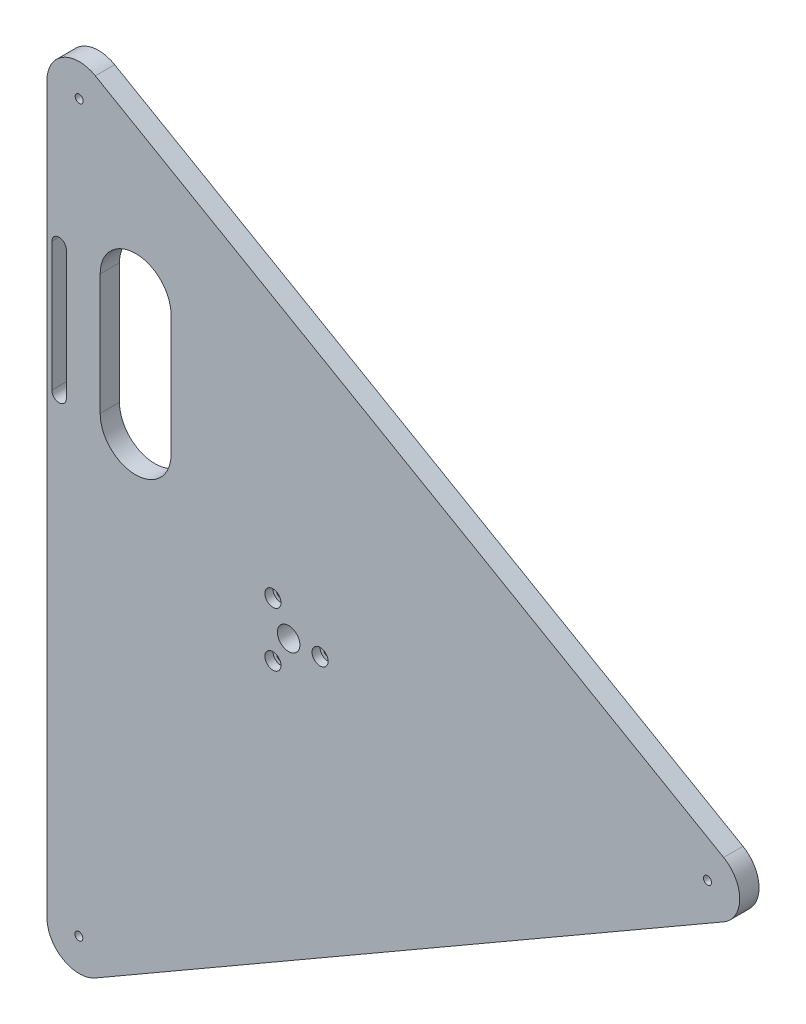
ISO-10303-21;
HEADER;
FILE_DESCRIPTION(('STEP AP214'),'2;1');
FILE_NAME('part.step','',(''),(''),'','','');
FILE_SCHEMA(('AUTOMOTIVE_DESIGN { 1 0 10303 214 1 1 1 1 }'));
ENDSEC;
DATA;
#1=APPLICATION_CONTEXT('core data for automotive mechanical design processes');
#2=APPLICATION_PROTOCOL_DEFINITION('international standard','automotive_design',2000,#1);
#3=PRODUCT_CONTEXT('',#1,'mechanical');
#4=PRODUCT('Part','Part','',(#3));
#5=PRODUCT_RELATED_PRODUCT_CATEGORY('part','',(#4));
#6=PRODUCT_DEFINITION_FORMATION('','',#4);
#7=PRODUCT_DEFINITION_CONTEXT('part definition',#1,'design');
#8=PRODUCT_DEFINITION('design','',#6,#7);
#9=PRODUCT_DEFINITION_SHAPE('','',#8);
#10=(LENGTH_UNIT() NAMED_UNIT(*) SI_UNIT(.MILLI.,.METRE.));
#11=(NAMED_UNIT(*) PLANE_ANGLE_UNIT() SI_UNIT($,.RADIAN.));
#12=(NAMED_UNIT(*) SI_UNIT($,.STERADIAN.) SOLID_ANGLE_UNIT());
#13=UNCERTAINTY_MEASURE_WITH_UNIT(LENGTH_MEASURE(1.E-05),#10,'distance_accuracy_value','');
#14=(GEOMETRIC_REPRESENTATION_CONTEXT(3) GLOBAL_UNCERTAINTY_ASSIGNED_CONTEXT((#13)) GLOBAL_UNIT_ASSIGNED_CONTEXT((#10,
#11,#12)) REPRESENTATION_CONTEXT('',''));
#15=CARTESIAN_POINT('',(0.,0.,0.));
#16=DIRECTION('',(0.,0.,1.));
#17=DIRECTION('',(1.,0.,0.));
#18=AXIS2_PLACEMENT_3D('',#15,#16,#17);
#19=CARTESIAN_POINT('',(-142.5,140.,-4.52762827229947E-13));
#20=DIRECTION('',(0.,0.,1.));
#21=DIRECTION('',(1.,0.,0.));
#22=AXIS2_PLACEMENT_3D('',#19,#20,#21);
#23=CYLINDRICAL_SURFACE('',#22,2.59999999999998);
#24=CARTESIAN_POINT('',(-142.5,140.,3.));
#25=DIRECTION('',(0.,0.,1.));
#26=DIRECTION('',(1.,0.,0.));
#27=AXIS2_PLACEMENT_3D('',#24,#25,#26);
#28=CIRCLE('',#27,2.59999999999998);
#29=CARTESIAN_POINT('',(-145.1,140.,3.));
#30=VERTEX_POINT('',#29);
#31=CARTESIAN_POINT('',(-139.9,140.,3.));
#32=VERTEX_POINT('',#31);
#33=EDGE_CURVE('E211',#30,#32,#28,.F.);
#34=ORIENTED_EDGE('',*,*,#33,.F.);
#35=DIRECTION('',(0.,0.,1.));
#36=VECTOR('',#35,1.);
#37=CARTESIAN_POINT('',(-145.1,140.,-4.52762827229947E-13));
#38=LINE('',#37,#36);
#39=CARTESIAN_POINT('',(-145.1,140.,-4.52762827229947E-13));
#40=VERTEX_POINT('',#39);
#41=EDGE_CURVE('E225',#40,#30,#38,.T.);
#42=ORIENTED_EDGE('',*,*,#41,.F.);
#43=CARTESIAN_POINT('',(-142.5,140.,-4.52762827229947E-13));
#44=DIRECTION('',(0.,0.,1.));
#45=DIRECTION('',(1.,0.,0.));
#46=AXIS2_PLACEMENT_3D('',#43,#44,#45);
#47=CIRCLE('',#46,2.59999999999998);
#48=CARTESIAN_POINT('',(-139.9,140.,-4.52762827229947E-13));
#49=VERTEX_POINT('',#48);
#50=EDGE_CURVE('E213',#49,#40,#47,.T.);
#51=ORIENTED_EDGE('',*,*,#50,.F.);
#52=DIRECTION('',(0.,0.,1.));
#53=VECTOR('',#52,1.);
#54=CARTESIAN_POINT('',(-139.9,140.,-4.52762827229947E-13));
#55=LINE('',#54,#53);
#56=EDGE_CURVE('E226',#49,#32,#55,.T.);
#57=ORIENTED_EDGE('',*,*,#56,.T.);
#58=EDGE_LOOP('',(#34,#42,#51,#57));
#59=FACE_BOUND('',#58,.T.);
#60=ADVANCED_FACE('F46',(#59),#23,.F.);
#61=CARTESIAN_POINT('',(-139.9,140.,-4.52762827229947E-13));
#62=DIRECTION('',(1.,0.,0.));
#63=DIRECTION('',(0.,1.,0.));
#64=AXIS2_PLACEMENT_3D('',#61,#62,#63);
#65=PLANE('',#64);
#66=DIRECTION('',(0.,-1.,0.));
#67=VECTOR('',#66,1.);
#68=CARTESIAN_POINT('',(-139.9,140.,3.));
#69=LINE('',#68,#67);
#70=CARTESIAN_POINT('',(-139.9,60.,3.));
#71=VERTEX_POINT('',#70);
#72=EDGE_CURVE('E209',#32,#71,#69,.T.);
#73=ORIENTED_EDGE('',*,*,#72,.F.);
#74=ORIENTED_EDGE('',*,*,#56,.F.);
#75=DIRECTION('',(0.,1.,0.));
#76=VECTOR('',#75,1.);
#77=CARTESIAN_POINT('',(-139.9,140.,-4.52762827229947E-13));
#78=LINE('',#77,#76);
#79=CARTESIAN_POINT('',(-139.9,60.,-4.52762827229947E-13));
#80=VERTEX_POINT('',#79);
#81=EDGE_CURVE('E222',#80,#49,#78,.T.);
#82=ORIENTED_EDGE('',*,*,#81,.F.);
#83=DIRECTION('',(0.,0.,1.));
#84=VECTOR('',#83,1.);
#85=CARTESIAN_POINT('',(-139.9,60.,-4.52762827229947E-13));
#86=LINE('',#85,#84);
#87=EDGE_CURVE('E230',#80,#71,#86,.T.);
#88=ORIENTED_EDGE('',*,*,#87,.T.);
#89=EDGE_LOOP('',(#73,#74,#82,#88));
#90=FACE_BOUND('',#89,.T.);
#91=ADVANCED_FACE('F398',(#90),#65,.F.);
#92=CARTESIAN_POINT('',(-142.5,60.,-4.52762827229947E-13));
#93=DIRECTION('',(0.,0.,1.));
#94=DIRECTION('',(1.,0.,0.));
#95=AXIS2_PLACEMENT_3D('',#92,#93,#94);
#96=CYLINDRICAL_SURFACE('',#95,2.59999999999998);
#97=CARTESIAN_POINT('',(-142.5,60.,3.));
#98=DIRECTION('',(0.,0.,1.));
#99=DIRECTION('',(1.,0.,0.));
#100=AXIS2_PLACEMENT_3D('',#97,#98,#99);
#101=CIRCLE('',#100,2.59999999999998);
#102=CARTESIAN_POINT('',(-145.1,60.,3.));
#103=VERTEX_POINT('',#102);
#104=EDGE_CURVE('E68',#71,#103,#101,.F.);
#105=ORIENTED_EDGE('',*,*,#104,.F.);
#106=ORIENTED_EDGE('',*,*,#87,.F.);
#107=CARTESIAN_POINT('',(-142.5,60.,-4.52762827229947E-13));
#108=DIRECTION('',(0.,0.,1.));
#109=DIRECTION('',(1.,0.,0.));
#110=AXIS2_PLACEMENT_3D('',#107,#108,#109);
#111=CIRCLE('',#110,2.59999999999998);
#112=CARTESIAN_POINT('',(-145.1,60.,0.));
#113=VERTEX_POINT('',#112);
#114=EDGE_CURVE('E219',#113,#80,#111,.T.);
#115=ORIENTED_EDGE('',*,*,#114,.F.);
#116=DIRECTION('',(0.,0.,1.));
#117=VECTOR('',#116,1.);
#118=CARTESIAN_POINT('',(-145.1,60.,-4.52762827229947E-13));
#119=LINE('',#118,#117);
#120=EDGE_CURVE('E233',#113,#103,#119,.T.);
#121=ORIENTED_EDGE('',*,*,#120,.T.);
#122=EDGE_LOOP('',(#105,#106,#115,#121));
#123=FACE_BOUND('',#122,.T.);
#124=ADVANCED_FACE('F404',(#123),#96,.F.);
#125=CARTESIAN_POINT('',(-145.1,140.,-4.52762827229947E-13));
#126=DIRECTION('',(-1.,0.,0.));
#127=DIRECTION('',(0.,-1.,0.));
#128=AXIS2_PLACEMENT_3D('',#125,#126,#127);
#129=PLANE('',#128);
#130=DIRECTION('',(0.,1.,0.));
#131=VECTOR('',#130,1.);
#132=CARTESIAN_POINT('',(-145.1,140.,3.));
#133=LINE('',#132,#131);
#134=EDGE_CURVE('E13',#103,#30,#133,.T.);
#135=ORIENTED_EDGE('',*,*,#134,.F.);
#136=ORIENTED_EDGE('',*,*,#120,.F.);
#137=DIRECTION('',(0.,-1.,0.));
#138=VECTOR('',#137,1.);
#139=CARTESIAN_POINT('',(-145.1,140.,-4.52762827229947E-13));
#140=LINE('',#139,#138);
#141=EDGE_CURVE('E216',#40,#113,#140,.T.);
#142=ORIENTED_EDGE('',*,*,#141,.F.);
#143=ORIENTED_EDGE('',*,*,#41,.T.);
#144=EDGE_LOOP('',(#135,#136,#142,#143));
#145=FACE_BOUND('',#144,.T.);
#146=ADVANCED_FACE('F410',(#145),#129,.F.);
#147=CARTESIAN_POINT('',(19.5,0.,12.));
#148=DIRECTION('',(0.,0.,1.));
#149=DIRECTION('',(1.,0.,0.));
#150=AXIS2_PLACEMENT_3D('',#147,#148,#149);
#151=CYLINDRICAL_SURFACE('',#150,2.75);
#152=CARTESIAN_POINT('',(19.5,0.,7.));
#153=DIRECTION('',(0.,0.,1.));
#154=DIRECTION('',(1.,0.,0.));
#155=AXIS2_PLACEMENT_3D('',#152,#153,#154);
#156=CIRCLE('',#155,2.75);
#157=CARTESIAN_POINT('',(22.25,0.,7.));
#158=VERTEX_POINT('',#157);
#159=EDGE_CURVE('E312',#158,#158,#156,.T.);
#160=ORIENTED_EDGE('',*,*,#159,.T.);
#161=EDGE_LOOP('',(#160));
#162=FACE_BOUND('',#161,.T.);
#163=CARTESIAN_POINT('',(19.5,0.,1.));
#164=DIRECTION('',(0.,0.,-1.));
#165=DIRECTION('',(-1.,0.,0.));
#166=AXIS2_PLACEMENT_3D('',#163,#164,#165);
#167=CIRCLE('',#166,2.75);
#168=CARTESIAN_POINT('',(16.75,0.,1.));
#169=VERTEX_POINT('',#168);
#170=EDGE_CURVE('E282',#169,#169,#167,.F.);
#171=ORIENTED_EDGE('',*,*,#170,.F.);
#172=EDGE_LOOP('',(#171));
#173=FACE_BOUND('',#172,.T.);
#174=ADVANCED_FACE('F600',(#162,#173),#151,.F.);
#175=CARTESIAN_POINT('',(0.,0.,-9.03790930983916E-13));
#176=DIRECTION('',(0.,0.,1.));
#177=DIRECTION('',(1.,0.,0.));
#178=AXIS2_PLACEMENT_3D('',#175,#176,#177);
#179=CYLINDRICAL_SURFACE('',#178,7.);
#180=CARTESIAN_POINT('',(0.,0.,12.));
#181=DIRECTION('',(0.,0.,1.));
#182=DIRECTION('',(1.,0.,0.));
#183=AXIS2_PLACEMENT_3D('',#180,#181,#182);
#184=CIRCLE('',#183,7.);
#185=CARTESIAN_POINT('',(7.,0.,12.));
#186=VERTEX_POINT('',#185);
#187=EDGE_CURVE('E303',#186,#186,#184,.T.);
#188=ORIENTED_EDGE('',*,*,#187,.T.);
#189=EDGE_LOOP('',(#188));
#190=FACE_BOUND('',#189,.T.);
#191=CARTESIAN_POINT('',(0.,0.,1.));
#192=DIRECTION('',(0.,0.,-1.));
#193=DIRECTION('',(-1.,0.,0.));
#194=AXIS2_PLACEMENT_3D('',#191,#192,#193);
#195=CIRCLE('',#194,7.);
#196=CARTESIAN_POINT('',(-7.,0.,1.));
#197=VERTEX_POINT('',#196);
#198=EDGE_CURVE('E279',#197,#197,#195,.F.);
#199=ORIENTED_EDGE('',*,*,#198,.F.);
#200=EDGE_LOOP('',(#199));
#201=FACE_BOUND('',#200,.T.);
#202=ADVANCED_FACE('F392',(#190,#201),#179,.F.);
#203=CARTESIAN_POINT('',(-9.75000000000008,16.8874953737965,12.));
#204=DIRECTION('',(0.,0.,1.));
#205=DIRECTION('',(1.,0.,0.));
#206=AXIS2_PLACEMENT_3D('',#203,#204,#205);
#207=CYLINDRICAL_SURFACE('',#206,2.75);
#208=CARTESIAN_POINT('',(-9.75000000000008,16.8874953737965,7.));
#209=DIRECTION('',(0.,0.,1.));
#210=DIRECTION('',(1.,0.,0.));
#211=AXIS2_PLACEMENT_3D('',#208,#209,#210);
#212=CIRCLE('',#211,2.75);
#213=CARTESIAN_POINT('',(-7.00000000000008,16.8874953737965,7.));
#214=VERTEX_POINT('',#213);
#215=EDGE_CURVE('E300',#214,#214,#212,.T.);
#216=ORIENTED_EDGE('',*,*,#215,.T.);
#217=EDGE_LOOP('',(#216));
#218=FACE_BOUND('',#217,.T.);
#219=CARTESIAN_POINT('',(-9.75000000000008,16.8874953737965,1.));
#220=DIRECTION('',(0.,0.,-1.));
#221=DIRECTION('',(-1.,0.,0.));
#222=AXIS2_PLACEMENT_3D('',#219,#220,#221);
#223=CIRCLE('',#222,2.75);
#224=CARTESIAN_POINT('',(-12.5000000000001,16.8874953737965,1.));
#225=VERTEX_POINT('',#224);
#226=EDGE_CURVE('E276',#225,#225,#223,.F.);
#227=ORIENTED_EDGE('',*,*,#226,.F.);
#228=EDGE_LOOP('',(#227));
#229=FACE_BOUND('',#228,.T.);
#230=ADVANCED_FACE('F383',(#218,#229),#207,.F.);
#231=CARTESIAN_POINT('',(-9.74999999999985,-16.8874953737966,12.));
#232=DIRECTION('',(0.,0.,1.));
#233=DIRECTION('',(1.,0.,0.));
#234=AXIS2_PLACEMENT_3D('',#231,#232,#233);
#235=CYLINDRICAL_SURFACE('',#234,2.75);
#236=CARTESIAN_POINT('',(-9.74999999999985,-16.8874953737966,7.));
#237=DIRECTION('',(0.,0.,1.));
#238=DIRECTION('',(1.,0.,0.));
#239=AXIS2_PLACEMENT_3D('',#236,#237,#238);
#240=CIRCLE('',#239,2.75);
#241=CARTESIAN_POINT('',(-6.99999999999985,-16.8874953737966,7.));
#242=VERTEX_POINT('',#241);
#243=EDGE_CURVE('E291',#242,#242,#240,.T.);
#244=ORIENTED_EDGE('',*,*,#243,.T.);
#245=EDGE_LOOP('',(#244));
#246=FACE_BOUND('',#245,.T.);
#247=CARTESIAN_POINT('',(-9.74999999999985,-16.8874953737966,1.));
#248=DIRECTION('',(0.,0.,-1.));
#249=DIRECTION('',(-1.,0.,0.));
#250=AXIS2_PLACEMENT_3D('',#247,#248,#249);
#251=CIRCLE('',#250,2.75);
#252=CARTESIAN_POINT('',(-12.4999999999998,-16.8874953737966,1.));
#253=VERTEX_POINT('',#252);
#254=EDGE_CURVE('E273',#253,#253,#251,.F.);
#255=ORIENTED_EDGE('',*,*,#254,.F.);
#256=EDGE_LOOP('',(#255));
#257=FACE_BOUND('',#256,.T.);
#258=ADVANCED_FACE('F381',(#246,#257),#235,.F.);
#259=CARTESIAN_POINT('',(260.000000000001,0.,12.));
#260=DIRECTION('',(0.,0.,-1.));
#261=DIRECTION('',(-1.,0.,0.));
#262=AXIS2_PLACEMENT_3D('',#259,#260,#261);
#263=CYLINDRICAL_SURFACE('',#262,20.);
#264=CARTESIAN_POINT('',(260.000000000001,0.,0.));
#265=DIRECTION('',(0.,0.,1.));
#266=DIRECTION('',(-1.,0.,0.));
#267=AXIS2_PLACEMENT_3D('',#264,#265,#266);
#268=CIRCLE('',#267,20.);
#269=CARTESIAN_POINT('',(270.000000000001,-17.3205080756889,0.));
#270=VERTEX_POINT('',#269);
#271=CARTESIAN_POINT('',(270.000000000001,17.320508075689,0.));
#272=VERTEX_POINT('',#271);
#273=EDGE_CURVE('E333',#270,#272,#268,.T.);
#274=ORIENTED_EDGE('',*,*,#273,.T.);
#275=DIRECTION('',(0.,0.,-1.));
#276=VECTOR('',#275,1.);
#277=CARTESIAN_POINT('',(270.000000000001,17.320508075689,12.));
#278=LINE('',#277,#276);
#279=CARTESIAN_POINT('',(270.000000000001,17.320508075689,12.));
#280=VERTEX_POINT('',#279);
#281=EDGE_CURVE('E54',#280,#272,#278,.T.);
#282=ORIENTED_EDGE('',*,*,#281,.F.);
#283=CARTESIAN_POINT('',(260.000000000001,0.,12.));
#284=DIRECTION('',(0.,0.,1.));
#285=DIRECTION('',(-1.,0.,0.));
#286=AXIS2_PLACEMENT_3D('',#283,#284,#285);
#287=CIRCLE('',#286,20.);
#288=CARTESIAN_POINT('',(270.000000000001,-17.3205080756889,12.));
#289=VERTEX_POINT('',#288);
#290=EDGE_CURVE('E334',#289,#280,#287,.T.);
#291=ORIENTED_EDGE('',*,*,#290,.F.);
#292=DIRECTION('',(0.,0.,-1.));
#293=VECTOR('',#292,1.);
#294=CARTESIAN_POINT('',(270.000000000001,-17.3205080756889,12.));
#295=LINE('',#294,#293);
#296=EDGE_CURVE('E348',#289,#270,#295,.T.);
#297=ORIENTED_EDGE('',*,*,#296,.T.);
#298=EDGE_LOOP('',(#274,#282,#291,#297));
#299=FACE_BOUND('',#298,.T.);
#300=ADVANCED_FACE('F48',(#299),#263,.T.);
#301=CARTESIAN_POINT('',(270.000000000001,17.320508075689,12.));
#302=DIRECTION('',(-0.5,-0.866025403784439,0.));
#303=DIRECTION('',(0.866025403784439,-0.5,0.));
#304=AXIS2_PLACEMENT_3D('',#301,#302,#303);
#305=PLANE('',#304);
#306=DIRECTION('',(-0.866025403784439,0.5,0.));
#307=VECTOR('',#306,1.);
#308=CARTESIAN_POINT('',(270.000000000001,17.320508075689,0.));
#309=LINE('',#308,#307);
#310=CARTESIAN_POINT('',(-120.,242.487113059644,0.));
#311=VERTEX_POINT('',#310);
#312=EDGE_CURVE('E351',#272,#311,#309,.T.);
#313=ORIENTED_EDGE('',*,*,#312,.T.);
#314=DIRECTION('',(0.,0.,-1.));
#315=VECTOR('',#314,1.);
#316=CARTESIAN_POINT('',(-120.,242.487113059644,12.));
#317=LINE('',#316,#315);
#318=CARTESIAN_POINT('',(-120.,242.487113059644,12.));
#319=VERTEX_POINT('',#318);
#320=EDGE_CURVE('E371',#319,#311,#317,.T.);
#321=ORIENTED_EDGE('',*,*,#320,.F.);
#322=DIRECTION('',(-0.866025403784439,0.5,0.));
#323=VECTOR('',#322,1.);
#324=CARTESIAN_POINT('',(270.000000000001,17.320508075689,12.));
#325=LINE('',#324,#323);
#326=EDGE_CURVE('E337',#280,#319,#325,.T.);
#327=ORIENTED_EDGE('',*,*,#326,.F.);
#328=ORIENTED_EDGE('',*,*,#281,.T.);
#329=EDGE_LOOP('',(#313,#321,#327,#328));
#330=FACE_BOUND('',#329,.T.);
#331=ADVANCED_FACE('F390',(#330),#305,.F.);
#332=CARTESIAN_POINT('',(-130.000000000001,225.166604983955,12.));
#333=DIRECTION('',(0.,0.,-1.));
#334=DIRECTION('',(-1.,0.,0.));
#335=AXIS2_PLACEMENT_3D('',#332,#333,#334);
#336=CYLINDRICAL_SURFACE('',#335,20.);
#337=CARTESIAN_POINT('',(-130.000000000001,225.166604983955,0.));
#338=DIRECTION('',(0.,0.,1.));
#339=DIRECTION('',(1.,0.,0.));
#340=AXIS2_PLACEMENT_3D('',#337,#338,#339);
#341=CIRCLE('',#340,20.);
#342=CARTESIAN_POINT('',(-150.000000000001,225.166604983955,0.));
#343=VERTEX_POINT('',#342);
#344=EDGE_CURVE('E353',#311,#343,#341,.T.);
#345=ORIENTED_EDGE('',*,*,#344,.T.);
#346=DIRECTION('',(0.,0.,-1.));
#347=VECTOR('',#346,1.);
#348=CARTESIAN_POINT('',(-150.000000000001,225.166604983955,12.));
#349=LINE('',#348,#347);
#350=CARTESIAN_POINT('',(-150.000000000001,225.166604983955,12.));
#351=VERTEX_POINT('',#350);
#352=EDGE_CURVE('E368',#351,#343,#349,.T.);
#353=ORIENTED_EDGE('',*,*,#352,.F.);
#354=CARTESIAN_POINT('',(-130.000000000001,225.166604983955,12.));
#355=DIRECTION('',(0.,0.,1.));
#356=DIRECTION('',(1.,0.,0.));
#357=AXIS2_PLACEMENT_3D('',#354,#355,#356);
#358=CIRCLE('',#357,20.);
#359=EDGE_CURVE('E340',#319,#351,#358,.T.);
#360=ORIENTED_EDGE('',*,*,#359,.F.);
#361=ORIENTED_EDGE('',*,*,#320,.T.);
#362=EDGE_LOOP('',(#345,#353,#360,#361));
#363=FACE_BOUND('',#362,.T.);
#364=ADVANCED_FACE('F483',(#363),#336,.T.);
#365=CARTESIAN_POINT('',(-150.000000000001,225.166604983955,12.));
#366=DIRECTION('',(1.,0.,0.));
#367=DIRECTION('',(0.,1.,0.));
#368=AXIS2_PLACEMENT_3D('',#365,#366,#367);
#369=PLANE('',#368);
#370=DIRECTION('',(0.,-1.,0.));
#371=VECTOR('',#370,1.);
#372=CARTESIAN_POINT('',(-150.000000000001,225.166604983955,0.));
#373=LINE('',#372,#371);
#374=CARTESIAN_POINT('',(-150.000000000001,-225.166604983955,0.));
#375=VERTEX_POINT('',#374);
#376=EDGE_CURVE('E355',#343,#375,#373,.T.);
#377=ORIENTED_EDGE('',*,*,#376,.T.);
#378=DIRECTION('',(0.,0.,-1.));
#379=VECTOR('',#378,1.);
#380=CARTESIAN_POINT('',(-150.000000000001,-225.166604983955,12.));
#381=LINE('',#380,#379);
#382=CARTESIAN_POINT('',(-150.000000000001,-225.166604983955,12.));
#383=VERTEX_POINT('',#382);
#384=EDGE_CURVE('E365',#383,#375,#381,.T.);
#385=ORIENTED_EDGE('',*,*,#384,.F.);
#386=DIRECTION('',(0.,-1.,0.));
#387=VECTOR('',#386,1.);
#388=CARTESIAN_POINT('',(-150.000000000001,225.166604983955,12.));
#389=LINE('',#388,#387);
#390=EDGE_CURVE('E342',#351,#383,#389,.T.);
#391=ORIENTED_EDGE('',*,*,#390,.F.);
#392=ORIENTED_EDGE('',*,*,#352,.T.);
#393=EDGE_LOOP('',(#377,#385,#391,#392));
#394=FACE_BOUND('',#393,.T.);
#395=ADVANCED_FACE('F489',(#394),#369,.F.);
#396=CARTESIAN_POINT('',(-130.000000000001,-225.166604983955,12.));
#397=DIRECTION('',(0.,0.,-1.));
#398=DIRECTION('',(-1.,0.,0.));
#399=AXIS2_PLACEMENT_3D('',#396,#397,#398);
#400=CYLINDRICAL_SURFACE('',#399,20.);
#401=CARTESIAN_POINT('',(-130.000000000001,-225.166604983955,0.));
#402=DIRECTION('',(0.,0.,1.));
#403=DIRECTION('',(1.,0.,0.));
#404=AXIS2_PLACEMENT_3D('',#401,#402,#403);
#405=CIRCLE('',#404,20.);
#406=CARTESIAN_POINT('',(-120.,-242.487113059644,0.));
#407=VERTEX_POINT('',#406);
#408=EDGE_CURVE('E357',#375,#407,#405,.T.);
#409=ORIENTED_EDGE('',*,*,#408,.T.);
#410=DIRECTION('',(0.,0.,-1.));
#411=VECTOR('',#410,1.);
#412=CARTESIAN_POINT('',(-120.,-242.487113059644,12.));
#413=LINE('',#412,#411);
#414=CARTESIAN_POINT('',(-120.,-242.487113059644,12.));
#415=VERTEX_POINT('',#414);
#416=EDGE_CURVE('E362',#415,#407,#413,.T.);
#417=ORIENTED_EDGE('',*,*,#416,.F.);
#418=CARTESIAN_POINT('',(-130.000000000001,-225.166604983955,12.));
#419=DIRECTION('',(0.,0.,1.));
#420=DIRECTION('',(1.,0.,0.));
#421=AXIS2_PLACEMENT_3D('',#418,#419,#420);
#422=CIRCLE('',#421,20.);
#423=EDGE_CURVE('E344',#383,#415,#422,.T.);
#424=ORIENTED_EDGE('',*,*,#423,.F.);
#425=ORIENTED_EDGE('',*,*,#384,.T.);
#426=EDGE_LOOP('',(#409,#417,#424,#425));
#427=FACE_BOUND('',#426,.T.);
#428=ADVANCED_FACE('F493',(#427),#400,.T.);
#429=CARTESIAN_POINT('',(-120.,-242.487113059644,12.));
#430=DIRECTION('',(-0.5,0.866025403784439,0.));
#431=DIRECTION('',(-0.866025403784439,-0.5,0.));
#432=AXIS2_PLACEMENT_3D('',#429,#430,#431);
#433=PLANE('',#432);
#434=DIRECTION('',(0.866025403784439,0.5,0.));
#435=VECTOR('',#434,1.);
#436=CARTESIAN_POINT('',(-120.,-242.487113059644,0.));
#437=LINE('',#436,#435);
#438=EDGE_CURVE('E338',#407,#270,#437,.T.);
#439=ORIENTED_EDGE('',*,*,#438,.T.);
#440=ORIENTED_EDGE('',*,*,#296,.F.);
#441=DIRECTION('',(0.866025403784439,0.5,0.));
#442=VECTOR('',#441,1.);
#443=CARTESIAN_POINT('',(-120.,-242.487113059644,12.));
#444=LINE('',#443,#442);
#445=EDGE_CURVE('E346',#415,#289,#444,.T.);
#446=ORIENTED_EDGE('',*,*,#445,.F.);
#447=ORIENTED_EDGE('',*,*,#416,.T.);
#448=EDGE_LOOP('',(#439,#440,#446,#447));
#449=FACE_BOUND('',#448,.T.);
#450=ADVANCED_FACE('F457',(#449),#433,.F.);
#451=CARTESIAN_POINT('',(260.000000000001,0.,12.));
#452=DIRECTION('',(0.,0.,-1.));
#453=DIRECTION('',(-1.,0.,0.));
#454=AXIS2_PLACEMENT_3D('',#451,#452,#453);
#455=PLANE('',#454);
#456=DIRECTION('',(0.,-1.,0.));
#457=VECTOR('',#456,1.);
#458=CARTESIAN_POINT('',(-147.,140.,12.));
#459=LINE('',#458,#457);
#460=CARTESIAN_POINT('',(-147.,140.,12.));
#461=VERTEX_POINT('',#460);
#462=CARTESIAN_POINT('',(-147.,60.,12.));
#463=VERTEX_POINT('',#462);
#464=EDGE_CURVE('E199',#461,#463,#459,.T.);
#465=ORIENTED_EDGE('',*,*,#464,.F.);
#466=CARTESIAN_POINT('',(-142.5,140.,12.));
#467=DIRECTION('',(0.,0.,1.));
#468=DIRECTION('',(1.,0.,0.));
#469=AXIS2_PLACEMENT_3D('',#466,#467,#468);
#470=CIRCLE('',#469,4.50000000000002);
#471=CARTESIAN_POINT('',(-138.,140.,12.));
#472=VERTEX_POINT('',#471);
#473=EDGE_CURVE('E61',#472,#461,#470,.T.);
#474=ORIENTED_EDGE('',*,*,#473,.F.);
#475=DIRECTION('',(0.,1.,0.));
#476=VECTOR('',#475,1.);
#477=CARTESIAN_POINT('',(-138.,140.,12.));
#478=LINE('',#477,#476);
#479=CARTESIAN_POINT('',(-138.,60.,12.));
#480=VERTEX_POINT('',#479);
#481=EDGE_CURVE('E190',#480,#472,#478,.T.);
#482=ORIENTED_EDGE('',*,*,#481,.F.);
#483=CARTESIAN_POINT('',(-142.5,60.,12.));
#484=DIRECTION('',(0.,0.,1.));
#485=DIRECTION('',(1.,0.,0.));
#486=AXIS2_PLACEMENT_3D('',#483,#484,#485);
#487=CIRCLE('',#486,4.50000000000002);
#488=EDGE_CURVE('E193',#463,#480,#487,.T.);
#489=ORIENTED_EDGE('',*,*,#488,.F.);
#490=EDGE_LOOP('',(#465,#474,#482,#489));
#491=FACE_BOUND('',#490,.T.);
#492=DIRECTION('',(0.,1.,0.));
#493=VECTOR('',#492,1.);
#494=CARTESIAN_POINT('',(-117.,137.502524439289,12.));
#495=LINE('',#494,#493);
#496=CARTESIAN_POINT('',(-117.,62.4974755607113,12.));
#497=VERTEX_POINT('',#496);
#498=CARTESIAN_POINT('',(-117.,137.502524439289,12.));
#499=VERTEX_POINT('',#498);
#500=EDGE_CURVE('E248',#497,#499,#495,.T.);
#501=ORIENTED_EDGE('',*,*,#500,.T.);
#502=CARTESIAN_POINT('',(-95.,137.502524439289,12.));
#503=DIRECTION('',(0.,0.,-1.));
#504=DIRECTION('',(-1.,0.,0.));
#505=AXIS2_PLACEMENT_3D('',#502,#503,#504);
#506=CIRCLE('',#505,22.);
#507=CARTESIAN_POINT('',(-73.,137.502524439289,12.));
#508=VERTEX_POINT('',#507);
#509=EDGE_CURVE('E238',#499,#508,#506,.T.);
#510=ORIENTED_EDGE('',*,*,#509,.T.);
#511=DIRECTION('',(0.,-1.,0.));
#512=VECTOR('',#511,1.);
#513=CARTESIAN_POINT('',(-73.,137.502524439289,12.));
#514=LINE('',#513,#512);
#515=CARTESIAN_POINT('',(-73.,62.4974755607113,12.));
#516=VERTEX_POINT('',#515);
#517=EDGE_CURVE('E241',#508,#516,#514,.T.);
#518=ORIENTED_EDGE('',*,*,#517,.T.);
#519=CARTESIAN_POINT('',(-95.,62.4974755607113,12.));
#520=DIRECTION('',(0.,0.,-1.));
#521=DIRECTION('',(-1.,0.,0.));
#522=AXIS2_PLACEMENT_3D('',#519,#520,#521);
#523=CIRCLE('',#522,22.);
#524=EDGE_CURVE('E245',#516,#497,#523,.T.);
#525=ORIENTED_EDGE('',*,*,#524,.T.);
#526=EDGE_LOOP('',(#501,#510,#518,#525));
#527=FACE_BOUND('',#526,.T.);
#528=CARTESIAN_POINT('',(-9.74999999999985,-16.8874953737966,12.));
#529=DIRECTION('',(0.,0.,1.));
#530=DIRECTION('',(1.,0.,0.));
#531=AXIS2_PLACEMENT_3D('',#528,#529,#530);
#532=CIRCLE('',#531,5.);
#533=CARTESIAN_POINT('',(-4.74999999999985,-16.8874953737966,12.));
#534=VERTEX_POINT('',#533);
#535=EDGE_CURVE('E285',#534,#534,#532,.T.);
#536=ORIENTED_EDGE('',*,*,#535,.F.);
#537=EDGE_LOOP('',(#536));
#538=FACE_BOUND('',#537,.T.);
#539=CARTESIAN_POINT('',(-9.75000000000008,16.8874953737965,12.));
#540=DIRECTION('',(0.,0.,1.));
#541=DIRECTION('',(1.,0.,0.));
#542=AXIS2_PLACEMENT_3D('',#539,#540,#541);
#543=CIRCLE('',#542,5.);
#544=CARTESIAN_POINT('',(-4.75000000000008,16.8874953737965,12.));
#545=VERTEX_POINT('',#544);
#546=EDGE_CURVE('E294',#545,#545,#543,.T.);
#547=ORIENTED_EDGE('',*,*,#546,.F.);
#548=EDGE_LOOP('',(#547));
#549=FACE_BOUND('',#548,.T.);
#550=ORIENTED_EDGE('',*,*,#187,.F.);
#551=EDGE_LOOP('',(#550));
#552=FACE_BOUND('',#551,.T.);
#553=CARTESIAN_POINT('',(19.5,0.,12.));
#554=DIRECTION('',(0.,0.,1.));
#555=DIRECTION('',(1.,0.,0.));
#556=AXIS2_PLACEMENT_3D('',#553,#554,#555);
#557=CIRCLE('',#556,5.);
#558=CARTESIAN_POINT('',(24.5,0.,12.));
#559=VERTEX_POINT('',#558);
#560=EDGE_CURVE('E306',#559,#559,#557,.T.);
#561=ORIENTED_EDGE('',*,*,#560,.F.);
#562=EDGE_LOOP('',(#561));
#563=FACE_BOUND('',#562,.T.);
#564=CARTESIAN_POINT('',(-130.26630914749,-225.083745366861,12.));
#565=DIRECTION('',(0.,0.,1.));
#566=DIRECTION('',(1.,0.,0.));
#567=AXIS2_PLACEMENT_3D('',#564,#565,#566);
#568=CIRCLE('',#567,2.49999999999997);
#569=CARTESIAN_POINT('',(-127.76630914749,-225.083745366861,12.));
#570=VERTEX_POINT('',#569);
#571=EDGE_CURVE('E315',#570,#570,#568,.T.);
#572=ORIENTED_EDGE('',*,*,#571,.F.);
#573=EDGE_LOOP('',(#572));
#574=FACE_BOUND('',#573,.T.);
#575=CARTESIAN_POINT('',(-130.000000000001,225.166604983955,12.));
#576=DIRECTION('',(0.,0.,1.));
#577=DIRECTION('',(1.,0.,0.));
#578=AXIS2_PLACEMENT_3D('',#575,#576,#577);
#579=CIRCLE('',#578,2.5);
#580=CARTESIAN_POINT('',(-127.500000000001,225.166604983955,12.));
#581=VERTEX_POINT('',#580);
#582=EDGE_CURVE('E321',#581,#581,#579,.T.);
#583=ORIENTED_EDGE('',*,*,#582,.F.);
#584=EDGE_LOOP('',(#583));
#585=FACE_BOUND('',#584,.T.);
#586=CARTESIAN_POINT('',(260.000000000001,0.,12.));
#587=DIRECTION('',(0.,0.,-1.));
#588=DIRECTION('',(-1.,0.,0.));
#589=AXIS2_PLACEMENT_3D('',#586,#587,#588);
#590=CIRCLE('',#589,2.5);
#591=CARTESIAN_POINT('',(257.500000000001,0.,12.));
#592=VERTEX_POINT('',#591);
#593=EDGE_CURVE('E330',#592,#592,#590,.T.);
#594=ORIENTED_EDGE('',*,*,#593,.T.);
#595=EDGE_LOOP('',(#594));
#596=FACE_BOUND('',#595,.T.);
#597=ORIENTED_EDGE('',*,*,#290,.T.);
#598=ORIENTED_EDGE('',*,*,#326,.T.);
#599=ORIENTED_EDGE('',*,*,#359,.T.);
#600=ORIENTED_EDGE('',*,*,#390,.T.);
#601=ORIENTED_EDGE('',*,*,#423,.T.);
#602=ORIENTED_EDGE('',*,*,#445,.T.);
#603=EDGE_LOOP('',(#597,#598,#599,#600,#601,#602));
#604=FACE_BOUND('',#603,.T.);
#605=ADVANCED_FACE('F453',(#491,#527,#538,#549,#552,#563,#574,#585,#596,#604),#455,.F.);
#606=CARTESIAN_POINT('',(260.000000000001,0.,0.));
#607=DIRECTION('',(0.,0.,-1.));
#608=DIRECTION('',(-1.,0.,0.));
#609=AXIS2_PLACEMENT_3D('',#606,#607,#608);
#610=PLANE('',#609);
#611=ORIENTED_EDGE('',*,*,#50,.T.);
#612=ORIENTED_EDGE('',*,*,#141,.T.);
#613=ORIENTED_EDGE('',*,*,#114,.T.);
#614=ORIENTED_EDGE('',*,*,#81,.T.);
#615=EDGE_LOOP('',(#611,#612,#613,#614));
#616=FACE_BOUND('',#615,.T.);
#617=CARTESIAN_POINT('',(-95.,137.502524439289,0.));
#618=DIRECTION('',(0.,0.,-1.));
#619=DIRECTION('',(-1.,0.,0.));
#620=AXIS2_PLACEMENT_3D('',#617,#618,#619);
#621=CIRCLE('',#620,22.);
#622=CARTESIAN_POINT('',(-117.,137.502524439289,0.));
#623=VERTEX_POINT('',#622);
#624=CARTESIAN_POINT('',(-73.,137.502524439289,0.));
#625=VERTEX_POINT('',#624);
#626=EDGE_CURVE('E229',#623,#625,#621,.T.);
#627=ORIENTED_EDGE('',*,*,#626,.F.);
#628=DIRECTION('',(0.,1.,0.));
#629=VECTOR('',#628,1.);
#630=CARTESIAN_POINT('',(-117.,137.502524439289,0.));
#631=LINE('',#630,#629);
#632=CARTESIAN_POINT('',(-117.,62.4974755607113,0.));
#633=VERTEX_POINT('',#632);
#634=EDGE_CURVE('E242',#633,#623,#631,.T.);
#635=ORIENTED_EDGE('',*,*,#634,.F.);
#636=CARTESIAN_POINT('',(-95.,62.4974755607113,0.));
#637=DIRECTION('',(0.,0.,-1.));
#638=DIRECTION('',(-1.,0.,0.));
#639=AXIS2_PLACEMENT_3D('',#636,#637,#638);
#640=CIRCLE('',#639,22.);
#641=CARTESIAN_POINT('',(-73.,62.4974755607113,0.));
#642=VERTEX_POINT('',#641);
#643=EDGE_CURVE('E256',#642,#633,#640,.T.);
#644=ORIENTED_EDGE('',*,*,#643,.F.);
#645=DIRECTION('',(0.,-1.,0.));
#646=VECTOR('',#645,1.);
#647=CARTESIAN_POINT('',(-73.,137.502524439289,0.));
#648=LINE('',#647,#646);
#649=EDGE_CURVE('E253',#625,#642,#648,.T.);
#650=ORIENTED_EDGE('',*,*,#649,.F.);
#651=EDGE_LOOP('',(#627,#635,#644,#650));
#652=FACE_BOUND('',#651,.T.);
#653=CARTESIAN_POINT('',(0.,0.,0.));
#654=DIRECTION('',(0.,0.,-1.));
#655=DIRECTION('',(-1.,0.,0.));
#656=AXIS2_PLACEMENT_3D('',#653,#654,#655);
#657=CIRCLE('',#656,23.25);
#658=CARTESIAN_POINT('',(-23.25,0.,0.));
#659=VERTEX_POINT('',#658);
#660=EDGE_CURVE('E263',#659,#659,#657,.T.);
#661=ORIENTED_EDGE('',*,*,#660,.F.);
#662=EDGE_LOOP('',(#661));
#663=FACE_BOUND('',#662,.T.);
#664=CARTESIAN_POINT('',(-130.26630914749,-225.083745366861,-4.52762827229947E-13));
#665=DIRECTION('',(0.,0.,1.));
#666=DIRECTION('',(1.,0.,0.));
#667=AXIS2_PLACEMENT_3D('',#664,#665,#666);
#668=CIRCLE('',#667,2.5);
#669=CARTESIAN_POINT('',(-127.76630914749,-225.083745366861,-4.52762827229947E-13));
#670=VERTEX_POINT('',#669);
#671=EDGE_CURVE('E318',#670,#670,#668,.T.);
#672=ORIENTED_EDGE('',*,*,#671,.T.);
#673=EDGE_LOOP('',(#672));
#674=FACE_BOUND('',#673,.T.);
#675=CARTESIAN_POINT('',(-130.000000000001,225.166604983955,-4.52762827229947E-13));
#676=DIRECTION('',(0.,0.,1.));
#677=DIRECTION('',(1.,0.,0.));
#678=AXIS2_PLACEMENT_3D('',#675,#676,#677);
#679=CIRCLE('',#678,2.5);
#680=CARTESIAN_POINT('',(-127.500000000001,225.166604983955,-4.52762827229947E-13));
#681=VERTEX_POINT('',#680);
#682=EDGE_CURVE('E324',#681,#681,#679,.T.);
#683=ORIENTED_EDGE('',*,*,#682,.T.);
#684=EDGE_LOOP('',(#683));
#685=FACE_BOUND('',#684,.T.);
#686=CARTESIAN_POINT('',(260.000000000001,0.,0.));
#687=DIRECTION('',(0.,0.,-1.));
#688=DIRECTION('',(-1.,0.,0.));
#689=AXIS2_PLACEMENT_3D('',#686,#687,#688);
#690=CIRCLE('',#689,2.5);
#691=CARTESIAN_POINT('',(257.500000000001,0.,0.));
#692=VERTEX_POINT('',#691);
#693=EDGE_CURVE('E327',#692,#692,#690,.T.);
#694=ORIENTED_EDGE('',*,*,#693,.F.);
#695=EDGE_LOOP('',(#694));
#696=FACE_BOUND('',#695,.T.);
#697=ORIENTED_EDGE('',*,*,#273,.F.);
#698=ORIENTED_EDGE('',*,*,#438,.F.);
#699=ORIENTED_EDGE('',*,*,#408,.F.);
#700=ORIENTED_EDGE('',*,*,#376,.F.);
#701=ORIENTED_EDGE('',*,*,#344,.F.);
#702=ORIENTED_EDGE('',*,*,#312,.F.);
#703=EDGE_LOOP('',(#697,#698,#699,#700,#701,#702));
#704=FACE_BOUND('',#703,.T.);
#705=ADVANCED_FACE('F456',(#616,#652,#663,#674,#685,#696,#704),#610,.T.);
#706=CARTESIAN_POINT('',(260.000000000001,0.,0.));
#707=DIRECTION('',(0.,0.,-1.));
#708=DIRECTION('',(-1.,0.,0.));
#709=AXIS2_PLACEMENT_3D('',#706,#707,#708);
#710=CYLINDRICAL_SURFACE('',#709,2.5);
#711=ORIENTED_EDGE('',*,*,#593,.F.);
#712=EDGE_LOOP('',(#711));
#713=FACE_BOUND('',#712,.T.);
#714=ORIENTED_EDGE('',*,*,#693,.T.);
#715=EDGE_LOOP('',(#714));
#716=FACE_BOUND('',#715,.T.);
#717=ADVANCED_FACE('F498',(#713,#716),#710,.F.);
#718=CARTESIAN_POINT('',(-130.000000000001,225.166604983955,12.));
#719=DIRECTION('',(0.,0.,1.));
#720=DIRECTION('',(1.,0.,0.));
#721=AXIS2_PLACEMENT_3D('',#718,#719,#720);
#722=CYLINDRICAL_SURFACE('',#721,2.5);
#723=ORIENTED_EDGE('',*,*,#682,.F.);
#724=EDGE_LOOP('',(#723));
#725=FACE_BOUND('',#724,.T.);
#726=ORIENTED_EDGE('',*,*,#582,.T.);
#727=EDGE_LOOP('',(#726));
#728=FACE_BOUND('',#727,.T.);
#729=ADVANCED_FACE('F504',(#725,#728),#722,.F.);
#730=CARTESIAN_POINT('',(-130.26630914749,-225.083745366861,12.));
#731=DIRECTION('',(0.,0.,1.));
#732=DIRECTION('',(1.,0.,0.));
#733=AXIS2_PLACEMENT_3D('',#730,#731,#732);
#734=CYLINDRICAL_SURFACE('',#733,2.49999999999999);
#735=ORIENTED_EDGE('',*,*,#671,.F.);
#736=EDGE_LOOP('',(#735));
#737=FACE_BOUND('',#736,.T.);
#738=ORIENTED_EDGE('',*,*,#571,.T.);
#739=EDGE_LOOP('',(#738));
#740=FACE_BOUND('',#739,.T.);
#741=ADVANCED_FACE('F621',(#737,#740),#734,.F.);
#742=CARTESIAN_POINT('',(22.25,0.,7.));
#743=DIRECTION('',(0.,0.,-1.));
#744=DIRECTION('',(-1.,0.,0.));
#745=AXIS2_PLACEMENT_3D('',#742,#743,#744);
#746=PLANE('',#745);
#747=ORIENTED_EDGE('',*,*,#159,.F.);
#748=EDGE_LOOP('',(#747));
#749=FACE_BOUND('',#748,.T.);
#750=CARTESIAN_POINT('',(19.5,0.,7.));
#751=DIRECTION('',(0.,0.,1.));
#752=DIRECTION('',(1.,0.,0.));
#753=AXIS2_PLACEMENT_3D('',#750,#751,#752);
#754=CIRCLE('',#753,5.);
#755=CARTESIAN_POINT('',(24.5,0.,7.));
#756=VERTEX_POINT('',#755);
#757=EDGE_CURVE('E309',#756,#756,#754,.T.);
#758=ORIENTED_EDGE('',*,*,#757,.T.);
#759=EDGE_LOOP('',(#758));
#760=FACE_BOUND('',#759,.T.);
#761=ADVANCED_FACE('F619',(#749,#760),#746,.F.);
#762=CARTESIAN_POINT('',(19.5,0.,12.));
#763=DIRECTION('',(0.,0.,1.));
#764=DIRECTION('',(1.,0.,0.));
#765=AXIS2_PLACEMENT_3D('',#762,#763,#764);
#766=CYLINDRICAL_SURFACE('',#765,5.);
#767=ORIENTED_EDGE('',*,*,#757,.F.);
#768=EDGE_LOOP('',(#767));
#769=FACE_BOUND('',#768,.T.);
#770=ORIENTED_EDGE('',*,*,#560,.T.);
#771=EDGE_LOOP('',(#770));
#772=FACE_BOUND('',#771,.T.);
#773=ADVANCED_FACE('F646',(#769,#772),#766,.F.);
#774=CARTESIAN_POINT('',(-7.00000000000008,16.8874953737965,7.));
#775=DIRECTION('',(0.,0.,-1.));
#776=DIRECTION('',(-1.,0.,0.));
#777=AXIS2_PLACEMENT_3D('',#774,#775,#776);
#778=PLANE('',#777);
#779=ORIENTED_EDGE('',*,*,#215,.F.);
#780=EDGE_LOOP('',(#779));
#781=FACE_BOUND('',#780,.T.);
#782=CARTESIAN_POINT('',(-9.75000000000008,16.8874953737965,7.));
#783=DIRECTION('',(0.,0.,1.));
#784=DIRECTION('',(1.,0.,0.));
#785=AXIS2_PLACEMENT_3D('',#782,#783,#784);
#786=CIRCLE('',#785,5.);
#787=CARTESIAN_POINT('',(-4.75000000000008,16.8874953737965,7.));
#788=VERTEX_POINT('',#787);
#789=EDGE_CURVE('E297',#788,#788,#786,.T.);
#790=ORIENTED_EDGE('',*,*,#789,.T.);
#791=EDGE_LOOP('',(#790));
#792=FACE_BOUND('',#791,.T.);
#793=ADVANCED_FACE('F445',(#781,#792),#778,.F.);
#794=CARTESIAN_POINT('',(-9.75000000000008,16.8874953737965,12.));
#795=DIRECTION('',(0.,0.,1.));
#796=DIRECTION('',(1.,0.,0.));
#797=AXIS2_PLACEMENT_3D('',#794,#795,#796);
#798=CYLINDRICAL_SURFACE('',#797,5.);
#799=ORIENTED_EDGE('',*,*,#789,.F.);
#800=EDGE_LOOP('',(#799));
#801=FACE_BOUND('',#800,.T.);
#802=ORIENTED_EDGE('',*,*,#546,.T.);
#803=EDGE_LOOP('',(#802));
#804=FACE_BOUND('',#803,.T.);
#805=ADVANCED_FACE('F440',(#801,#804),#798,.F.);
#806=CARTESIAN_POINT('',(-6.99999999999985,-16.8874953737966,7.));
#807=DIRECTION('',(0.,0.,-1.));
#808=DIRECTION('',(-1.,0.,0.));
#809=AXIS2_PLACEMENT_3D('',#806,#807,#808);
#810=PLANE('',#809);
#811=ORIENTED_EDGE('',*,*,#243,.F.);
#812=EDGE_LOOP('',(#811));
#813=FACE_BOUND('',#812,.T.);
#814=CARTESIAN_POINT('',(-9.74999999999985,-16.8874953737966,7.));
#815=DIRECTION('',(0.,0.,1.));
#816=DIRECTION('',(1.,0.,0.));
#817=AXIS2_PLACEMENT_3D('',#814,#815,#816);
#818=CIRCLE('',#817,5.);
#819=CARTESIAN_POINT('',(-4.74999999999985,-16.8874953737966,7.));
#820=VERTEX_POINT('',#819);
#821=EDGE_CURVE('E288',#820,#820,#818,.T.);
#822=ORIENTED_EDGE('',*,*,#821,.T.);
#823=EDGE_LOOP('',(#822));
#824=FACE_BOUND('',#823,.T.);
#825=ADVANCED_FACE('F437',(#813,#824),#810,.F.);
#826=CARTESIAN_POINT('',(-9.74999999999985,-16.8874953737966,12.));
#827=DIRECTION('',(0.,0.,1.));
#828=DIRECTION('',(1.,0.,0.));
#829=AXIS2_PLACEMENT_3D('',#826,#827,#828);
#830=CYLINDRICAL_SURFACE('',#829,5.);
#831=ORIENTED_EDGE('',*,*,#821,.F.);
#832=EDGE_LOOP('',(#831));
#833=FACE_BOUND('',#832,.T.);
#834=ORIENTED_EDGE('',*,*,#535,.T.);
#835=EDGE_LOOP('',(#834));
#836=FACE_BOUND('',#835,.T.);
#837=ADVANCED_FACE('F431',(#833,#836),#830,.F.);
#838=CARTESIAN_POINT('',(0.,0.,1.));
#839=DIRECTION('',(0.,0.,-1.));
#840=DIRECTION('',(-1.,0.,0.));
#841=AXIS2_PLACEMENT_3D('',#838,#839,#840);
#842=PLANE('',#841);
#843=ORIENTED_EDGE('',*,*,#198,.T.);
#844=EDGE_LOOP('',(#843));
#845=FACE_BOUND('',#844,.T.);
#846=ORIENTED_EDGE('',*,*,#254,.T.);
#847=EDGE_LOOP('',(#846));
#848=FACE_BOUND('',#847,.T.);
#849=CARTESIAN_POINT('',(0.,0.,1.));
#850=DIRECTION('',(0.,0.,-1.));
#851=DIRECTION('',(-1.,0.,0.));
#852=AXIS2_PLACEMENT_3D('',#849,#850,#851);
#853=CIRCLE('',#852,23.25);
#854=CARTESIAN_POINT('',(-23.25,0.,1.));
#855=VERTEX_POINT('',#854);
#856=EDGE_CURVE('E270',#855,#855,#853,.T.);
#857=ORIENTED_EDGE('',*,*,#856,.T.);
#858=EDGE_LOOP('',(#857));
#859=FACE_BOUND('',#858,.T.);
#860=ORIENTED_EDGE('',*,*,#226,.T.);
#861=EDGE_LOOP('',(#860));
#862=FACE_BOUND('',#861,.T.);
#863=ORIENTED_EDGE('',*,*,#170,.T.);
#864=EDGE_LOOP('',(#863));
#865=FACE_BOUND('',#864,.T.);
#866=ADVANCED_FACE('F378',(#845,#848,#859,#862,#865),#842,.T.);
#867=CARTESIAN_POINT('',(0.,0.,1.));
#868=DIRECTION('',(0.,0.,-1.));
#869=DIRECTION('',(-1.,0.,0.));
#870=AXIS2_PLACEMENT_3D('',#867,#868,#869);
#871=CYLINDRICAL_SURFACE('',#870,23.25);
#872=ORIENTED_EDGE('',*,*,#856,.F.);
#873=EDGE_LOOP('',(#872));
#874=FACE_BOUND('',#873,.T.);
#875=ORIENTED_EDGE('',*,*,#660,.T.);
#876=EDGE_LOOP('',(#875));
#877=FACE_BOUND('',#876,.T.);
#878=ADVANCED_FACE('F427',(#874,#877),#871,.F.);
#879=CARTESIAN_POINT('',(-95.,137.502524439289,12.));
#880=DIRECTION('',(0.,0.,-1.));
#881=DIRECTION('',(-1.,0.,0.));
#882=AXIS2_PLACEMENT_3D('',#879,#880,#881);
#883=CYLINDRICAL_SURFACE('',#882,22.);
#884=ORIENTED_EDGE('',*,*,#626,.T.);
#885=DIRECTION('',(0.,0.,-1.));
#886=VECTOR('',#885,1.);
#887=CARTESIAN_POINT('',(-73.,137.502524439289,12.));
#888=LINE('',#887,#886);
#889=EDGE_CURVE('E251',#508,#625,#888,.T.);
#890=ORIENTED_EDGE('',*,*,#889,.F.);
#891=ORIENTED_EDGE('',*,*,#509,.F.);
#892=DIRECTION('',(0.,0.,-1.));
#893=VECTOR('',#892,1.);
#894=CARTESIAN_POINT('',(-117.,137.502524439289,12.));
#895=LINE('',#894,#893);
#896=EDGE_CURVE('E261',#499,#623,#895,.T.);
#897=ORIENTED_EDGE('',*,*,#896,.T.);
#898=EDGE_LOOP('',(#884,#890,#891,#897));
#899=FACE_BOUND('',#898,.T.);
#900=ADVANCED_FACE('F416',(#899),#883,.F.);
#901=CARTESIAN_POINT('',(-117.,137.502524439289,12.));
#902=DIRECTION('',(-1.,0.,0.));
#903=DIRECTION('',(0.,-1.,0.));
#904=AXIS2_PLACEMENT_3D('',#901,#902,#903);
#905=PLANE('',#904);
#906=ORIENTED_EDGE('',*,*,#634,.T.);
#907=ORIENTED_EDGE('',*,*,#896,.F.);
#908=ORIENTED_EDGE('',*,*,#500,.F.);
#909=DIRECTION('',(0.,0.,-1.));
#910=VECTOR('',#909,1.);
#911=CARTESIAN_POINT('',(-117.,62.4974755607113,12.));
#912=LINE('',#911,#910);
#913=EDGE_CURVE('E264',#497,#633,#912,.T.);
#914=ORIENTED_EDGE('',*,*,#913,.T.);
#915=EDGE_LOOP('',(#906,#907,#908,#914));
#916=FACE_BOUND('',#915,.T.);
#917=ADVANCED_FACE('F412',(#916),#905,.F.);
#918=CARTESIAN_POINT('',(-95.,62.4974755607113,12.));
#919=DIRECTION('',(0.,0.,-1.));
#920=DIRECTION('',(-1.,0.,0.));
#921=AXIS2_PLACEMENT_3D('',#918,#919,#920);
#922=CYLINDRICAL_SURFACE('',#921,22.);
#923=ORIENTED_EDGE('',*,*,#643,.T.);
#924=ORIENTED_EDGE('',*,*,#913,.F.);
#925=ORIENTED_EDGE('',*,*,#524,.F.);
#926=DIRECTION('',(0.,0.,-1.));
#927=VECTOR('',#926,1.);
#928=CARTESIAN_POINT('',(-73.,62.4974755607113,12.));
#929=LINE('',#928,#927);
#930=EDGE_CURVE('E266',#516,#642,#929,.T.);
#931=ORIENTED_EDGE('',*,*,#930,.T.);
#932=EDGE_LOOP('',(#923,#924,#925,#931));
#933=FACE_BOUND('',#932,.T.);
#934=ADVANCED_FACE('F415',(#933),#922,.F.);
#935=CARTESIAN_POINT('',(-73.,137.502524439289,12.));
#936=DIRECTION('',(1.,0.,0.));
#937=DIRECTION('',(0.,1.,0.));
#938=AXIS2_PLACEMENT_3D('',#935,#936,#937);
#939=PLANE('',#938);
#940=ORIENTED_EDGE('',*,*,#649,.T.);
#941=ORIENTED_EDGE('',*,*,#930,.F.);
#942=ORIENTED_EDGE('',*,*,#517,.F.);
#943=ORIENTED_EDGE('',*,*,#889,.T.);
#944=EDGE_LOOP('',(#940,#941,#942,#943));
#945=FACE_BOUND('',#944,.T.);
#946=ADVANCED_FACE('F420',(#945),#939,.F.);
#947=CARTESIAN_POINT('',(-142.5,140.,3.));
#948=DIRECTION('',(0.,0.,1.));
#949=DIRECTION('',(1.,0.,0.));
#950=AXIS2_PLACEMENT_3D('',#947,#948,#949);
#951=PLANE('',#950);
#952=CARTESIAN_POINT('',(-142.5,140.,3.));
#953=DIRECTION('',(0.,0.,1.));
#954=DIRECTION('',(1.,0.,0.));
#955=AXIS2_PLACEMENT_3D('',#952,#953,#954);
#956=CIRCLE('',#955,4.50000000000002);
#957=CARTESIAN_POINT('',(-138.,140.,3.));
#958=VERTEX_POINT('',#957);
#959=CARTESIAN_POINT('',(-147.,140.,3.));
#960=VERTEX_POINT('',#959);
#961=EDGE_CURVE('E172',#958,#960,#956,.T.);
#962=ORIENTED_EDGE('',*,*,#961,.T.);
#963=DIRECTION('',(0.,-1.,0.));
#964=VECTOR('',#963,1.);
#965=CARTESIAN_POINT('',(-147.,140.,3.));
#966=LINE('',#965,#964);
#967=CARTESIAN_POINT('',(-147.,60.,3.));
#968=VERTEX_POINT('',#967);
#969=EDGE_CURVE('E181',#960,#968,#966,.T.);
#970=ORIENTED_EDGE('',*,*,#969,.T.);
#971=CARTESIAN_POINT('',(-142.5,60.,3.));
#972=DIRECTION('',(0.,0.,1.));
#973=DIRECTION('',(1.,0.,0.));
#974=AXIS2_PLACEMENT_3D('',#971,#972,#973);
#975=CIRCLE('',#974,4.50000000000002);
#976=CARTESIAN_POINT('',(-138.,60.,3.));
#977=VERTEX_POINT('',#976);
#978=EDGE_CURVE('E186',#968,#977,#975,.T.);
#979=ORIENTED_EDGE('',*,*,#978,.T.);
#980=DIRECTION('',(0.,1.,0.));
#981=VECTOR('',#980,1.);
#982=CARTESIAN_POINT('',(-138.,140.,3.));
#983=LINE('',#982,#981);
#984=EDGE_CURVE('E178',#977,#958,#983,.T.);
#985=ORIENTED_EDGE('',*,*,#984,.T.);
#986=EDGE_LOOP('',(#962,#970,#979,#985));
#987=FACE_BOUND('',#986,.T.);
#988=ORIENTED_EDGE('',*,*,#33,.T.);
#989=ORIENTED_EDGE('',*,*,#72,.T.);
#990=ORIENTED_EDGE('',*,*,#104,.T.);
#991=ORIENTED_EDGE('',*,*,#134,.T.);
#992=EDGE_LOOP('',(#988,#989,#990,#991));
#993=FACE_BOUND('',#992,.T.);
#994=ADVANCED_FACE('F188',(#987,#993),#951,.T.);
#995=CARTESIAN_POINT('',(-142.5,140.,3.));
#996=DIRECTION('',(0.,0.,1.));
#997=DIRECTION('',(1.,0.,0.));
#998=AXIS2_PLACEMENT_3D('',#995,#996,#997);
#999=CYLINDRICAL_SURFACE('',#998,4.50000000000002);
#1000=ORIENTED_EDGE('',*,*,#473,.T.);
#1001=DIRECTION('',(0.,0.,1.));
#1002=VECTOR('',#1001,1.);
#1003=CARTESIAN_POINT('',(-147.,140.,3.));
#1004=LINE('',#1003,#1002);
#1005=EDGE_CURVE('E168',#960,#461,#1004,.T.);
#1006=ORIENTED_EDGE('',*,*,#1005,.F.);
#1007=ORIENTED_EDGE('',*,*,#961,.F.);
#1008=DIRECTION('',(0.,0.,1.));
#1009=VECTOR('',#1008,1.);
#1010=CARTESIAN_POINT('',(-138.,140.,3.));
#1011=LINE('',#1010,#1009);
#1012=EDGE_CURVE('E203',#958,#472,#1011,.T.);
#1013=ORIENTED_EDGE('',*,*,#1012,.T.);
#1014=EDGE_LOOP('',(#1000,#1006,#1007,#1013));
#1015=FACE_BOUND('',#1014,.T.);
#1016=ADVANCED_FACE('F170',(#1015),#999,.F.);
#1017=CARTESIAN_POINT('',(-138.,140.,3.));
#1018=DIRECTION('',(1.,0.,0.));
#1019=DIRECTION('',(0.,1.,0.));
#1020=AXIS2_PLACEMENT_3D('',#1017,#1018,#1019);
#1021=PLANE('',#1020);
#1022=ORIENTED_EDGE('',*,*,#481,.T.);
#1023=ORIENTED_EDGE('',*,*,#1012,.F.);
#1024=ORIENTED_EDGE('',*,*,#984,.F.);
#1025=DIRECTION('',(0.,0.,1.));
#1026=VECTOR('',#1025,1.);
#1027=CARTESIAN_POINT('',(-138.,60.,3.));
#1028=LINE('',#1027,#1026);
#1029=EDGE_CURVE('E205',#977,#480,#1028,.T.);
#1030=ORIENTED_EDGE('',*,*,#1029,.T.);
#1031=EDGE_LOOP('',(#1022,#1023,#1024,#1030));
#1032=FACE_BOUND('',#1031,.T.);
#1033=ADVANCED_FACE('F566',(#1032),#1021,.F.);
#1034=CARTESIAN_POINT('',(-142.5,60.,3.));
#1035=DIRECTION('',(0.,0.,1.));
#1036=DIRECTION('',(1.,0.,0.));
#1037=AXIS2_PLACEMENT_3D('',#1034,#1035,#1036);
#1038=CYLINDRICAL_SURFACE('',#1037,4.50000000000002);
#1039=ORIENTED_EDGE('',*,*,#488,.T.);
#1040=ORIENTED_EDGE('',*,*,#1029,.F.);
#1041=ORIENTED_EDGE('',*,*,#978,.F.);
#1042=DIRECTION('',(0.,0.,1.));
#1043=VECTOR('',#1042,1.);
#1044=CARTESIAN_POINT('',(-147.,60.,3.));
#1045=LINE('',#1044,#1043);
#1046=EDGE_CURVE('E177',#968,#463,#1045,.T.);
#1047=ORIENTED_EDGE('',*,*,#1046,.T.);
#1048=EDGE_LOOP('',(#1039,#1040,#1041,#1047));
#1049=FACE_BOUND('',#1048,.T.);
#1050=ADVANCED_FACE('F575',(#1049),#1038,.F.);
#1051=CARTESIAN_POINT('',(-147.,140.,3.));
#1052=DIRECTION('',(-1.,0.,0.));
#1053=DIRECTION('',(0.,-1.,0.));
#1054=AXIS2_PLACEMENT_3D('',#1051,#1052,#1053);
#1055=PLANE('',#1054);
#1056=ORIENTED_EDGE('',*,*,#464,.T.);
#1057=ORIENTED_EDGE('',*,*,#1046,.F.);
#1058=ORIENTED_EDGE('',*,*,#969,.F.);
#1059=ORIENTED_EDGE('',*,*,#1005,.T.);
#1060=EDGE_LOOP('',(#1056,#1057,#1058,#1059));
#1061=FACE_BOUND('',#1060,.T.);
#1062=ADVANCED_FACE('F182',(#1061),#1055,.F.);
#1063=CLOSED_SHELL('',(#60,#91,#124,#146,#174,#202,#230,#258,#300,#331,#364,#395,#428,#450,#605,
#705,#717,#729,#741,#761,#773,#793,#805,#825,#837,#866,#878,#900,#917,#934,#946,#994,#1016,
#1033,#1050,#1062));
#1064=MANIFOLD_SOLID_BREP('B2',#1063);
#1065=ADVANCED_BREP_SHAPE_REPRESENTATION('',(#18,#1064),#14);
#1066=SHAPE_DEFINITION_REPRESENTATION(#9,#1065);
ENDSEC;
END-ISO-10303-21;
